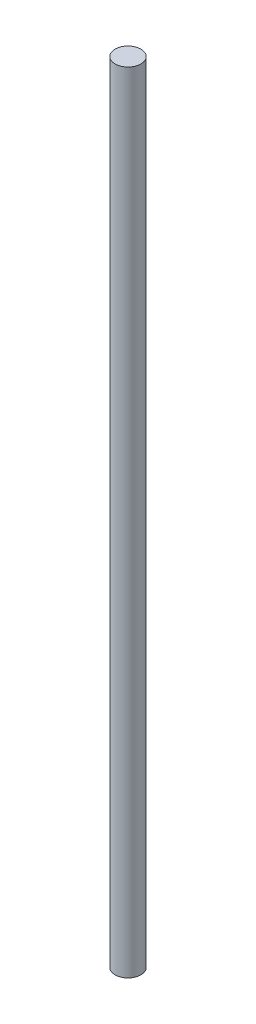
ISO-10303-21;
HEADER;
FILE_DESCRIPTION(('STEP AP214'),'2;1');
FILE_NAME('part.step','',(''),(''),'','','');
FILE_SCHEMA(('AUTOMOTIVE_DESIGN { 1 0 10303 214 1 1 1 1 }'));
ENDSEC;
DATA;
#1=APPLICATION_CONTEXT('core data for automotive mechanical design processes');
#2=APPLICATION_PROTOCOL_DEFINITION('international standard','automotive_design',2000,#1);
#3=PRODUCT_CONTEXT('',#1,'mechanical');
#4=PRODUCT('Part','Part','',(#3));
#5=PRODUCT_RELATED_PRODUCT_CATEGORY('part','',(#4));
#6=PRODUCT_DEFINITION_FORMATION('','',#4);
#7=PRODUCT_DEFINITION_CONTEXT('part definition',#1,'design');
#8=PRODUCT_DEFINITION('design','',#6,#7);
#9=PRODUCT_DEFINITION_SHAPE('','',#8);
#10=(LENGTH_UNIT() NAMED_UNIT(*) SI_UNIT(.MILLI.,.METRE.));
#11=(NAMED_UNIT(*) PLANE_ANGLE_UNIT() SI_UNIT($,.RADIAN.));
#12=(NAMED_UNIT(*) SI_UNIT($,.STERADIAN.) SOLID_ANGLE_UNIT());
#13=UNCERTAINTY_MEASURE_WITH_UNIT(LENGTH_MEASURE(1.E-05),#10,'distance_accuracy_value','');
#14=(GEOMETRIC_REPRESENTATION_CONTEXT(3) GLOBAL_UNCERTAINTY_ASSIGNED_CONTEXT((#13)) GLOBAL_UNIT_ASSIGNED_CONTEXT((#10,
#11,#12)) REPRESENTATION_CONTEXT('',''));
#15=CARTESIAN_POINT('',(0.,0.,0.));
#16=DIRECTION('',(0.,0.,1.));
#17=DIRECTION('',(1.,0.,0.));
#18=AXIS2_PLACEMENT_3D('',#15,#16,#17);
#19=CARTESIAN_POINT('',(0.,150.,0.));
#20=DIRECTION('',(0.,-1.,0.));
#21=DIRECTION('',(0.,0.,-1.));
#22=AXIS2_PLACEMENT_3D('',#19,#20,#21);
#23=CYLINDRICAL_SURFACE('',#22,2.45);
#24=CARTESIAN_POINT('',(0.,150.,0.));
#25=DIRECTION('',(0.,1.,0.));
#26=DIRECTION('',(0.,0.,1.));
#27=AXIS2_PLACEMENT_3D('',#24,#25,#26);
#28=CIRCLE('',#27,2.45);
#29=CARTESIAN_POINT('',(0.,150.,2.45));
#30=VERTEX_POINT('',#29);
#31=EDGE_CURVE('E10',#30,#30,#28,.T.);
#32=ORIENTED_EDGE('',*,*,#31,.F.);
#33=EDGE_LOOP('',(#32));
#34=FACE_BOUND('',#33,.T.);
#35=CARTESIAN_POINT('',(0.,0.,0.));
#36=DIRECTION('',(0.,1.,0.));
#37=DIRECTION('',(0.,0.,1.));
#38=AXIS2_PLACEMENT_3D('',#35,#36,#37);
#39=CIRCLE('',#38,2.45);
#40=CARTESIAN_POINT('',(0.,0.,2.45));
#41=VERTEX_POINT('',#40);
#42=EDGE_CURVE('E34',#41,#41,#39,.T.);
#43=ORIENTED_EDGE('',*,*,#42,.T.);
#44=EDGE_LOOP('',(#43));
#45=FACE_BOUND('',#44,.T.);
#46=ADVANCED_FACE('F31',(#34,#45),#23,.T.);
#47=CARTESIAN_POINT('',(0.,150.,0.));
#48=DIRECTION('',(0.,1.,0.));
#49=DIRECTION('',(0.,0.,1.));
#50=AXIS2_PLACEMENT_3D('',#47,#48,#49);
#51=PLANE('',#50);
#52=ORIENTED_EDGE('',*,*,#31,.T.);
#53=EDGE_LOOP('',(#52));
#54=FACE_BOUND('',#53,.T.);
#55=ADVANCED_FACE('F46',(#54),#51,.T.);
#56=CARTESIAN_POINT('',(0.,0.,0.));
#57=DIRECTION('',(0.,1.,0.));
#58=DIRECTION('',(0.,0.,1.));
#59=AXIS2_PLACEMENT_3D('',#56,#57,#58);
#60=PLANE('',#59);
#61=ORIENTED_EDGE('',*,*,#42,.F.);
#62=EDGE_LOOP('',(#61));
#63=FACE_BOUND('',#62,.T.);
#64=ADVANCED_FACE('F44',(#63),#60,.F.);
#65=CLOSED_SHELL('',(#46,#55,#64));
#66=MANIFOLD_SOLID_BREP('B2',#65);
#67=ADVANCED_BREP_SHAPE_REPRESENTATION('',(#18,#66),#14);
#68=SHAPE_DEFINITION_REPRESENTATION(#9,#67);
ENDSEC;
END-ISO-10303-21;
